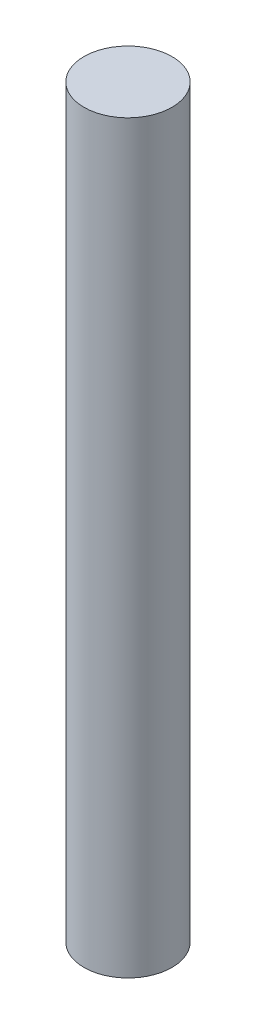
ISO-10303-21;
HEADER;
FILE_DESCRIPTION(('STEP AP214'),'2;1');
FILE_NAME('part.step','',(''),(''),'','','');
FILE_SCHEMA(('AUTOMOTIVE_DESIGN { 1 0 10303 214 1 1 1 1 }'));
ENDSEC;
DATA;
#1=APPLICATION_CONTEXT('core data for automotive mechanical design processes');
#2=APPLICATION_PROTOCOL_DEFINITION('international standard','automotive_design',2000,#1);
#3=PRODUCT_CONTEXT('',#1,'mechanical');
#4=PRODUCT('Part','Part','',(#3));
#5=PRODUCT_RELATED_PRODUCT_CATEGORY('part','',(#4));
#6=PRODUCT_DEFINITION_FORMATION('','',#4);
#7=PRODUCT_DEFINITION_CONTEXT('part definition',#1,'design');
#8=PRODUCT_DEFINITION('design','',#6,#7);
#9=PRODUCT_DEFINITION_SHAPE('','',#8);
#10=(LENGTH_UNIT() NAMED_UNIT(*) SI_UNIT(.MILLI.,.METRE.));
#11=(NAMED_UNIT(*) PLANE_ANGLE_UNIT() SI_UNIT($,.RADIAN.));
#12=(NAMED_UNIT(*) SI_UNIT($,.STERADIAN.) SOLID_ANGLE_UNIT());
#13=UNCERTAINTY_MEASURE_WITH_UNIT(LENGTH_MEASURE(1.E-05),#10,'distance_accuracy_value','');
#14=(GEOMETRIC_REPRESENTATION_CONTEXT(3) GLOBAL_UNCERTAINTY_ASSIGNED_CONTEXT((#13)) GLOBAL_UNIT_ASSIGNED_CONTEXT((#10,
#11,#12)) REPRESENTATION_CONTEXT('',''));
#15=CARTESIAN_POINT('',(0.,0.,0.));
#16=DIRECTION('',(0.,0.,1.));
#17=DIRECTION('',(1.,0.,0.));
#18=AXIS2_PLACEMENT_3D('',#15,#16,#17);
#19=CARTESIAN_POINT('',(0.,12.7,0.));
#20=DIRECTION('',(0.,-1.,0.));
#21=DIRECTION('',(0.,0.,-1.));
#22=AXIS2_PLACEMENT_3D('',#19,#20,#21);
#23=CYLINDRICAL_SURFACE('',#22,0.750000000000001);
#24=CARTESIAN_POINT('',(0.,12.7,0.));
#25=DIRECTION('',(0.,1.,0.));
#26=DIRECTION('',(0.,0.,1.));
#27=AXIS2_PLACEMENT_3D('',#24,#25,#26);
#28=CIRCLE('',#27,0.750000000000001);
#29=CARTESIAN_POINT('',(0.,12.7,0.750000000000001));
#30=VERTEX_POINT('',#29);
#31=EDGE_CURVE('E10',#30,#30,#28,.T.);
#32=ORIENTED_EDGE('',*,*,#31,.F.);
#33=EDGE_LOOP('',(#32));
#34=FACE_BOUND('',#33,.T.);
#35=CARTESIAN_POINT('',(0.,0.,0.));
#36=DIRECTION('',(0.,1.,0.));
#37=DIRECTION('',(0.,0.,1.));
#38=AXIS2_PLACEMENT_3D('',#35,#36,#37);
#39=CIRCLE('',#38,0.750000000000001);
#40=CARTESIAN_POINT('',(0.,0.,0.750000000000001));
#41=VERTEX_POINT('',#40);
#42=EDGE_CURVE('E32',#41,#41,#39,.T.);
#43=ORIENTED_EDGE('',*,*,#42,.T.);
#44=EDGE_LOOP('',(#43));
#45=FACE_BOUND('',#44,.T.);
#46=ADVANCED_FACE('F29',(#34,#45),#23,.T.);
#47=CARTESIAN_POINT('',(0.,12.7,0.));
#48=DIRECTION('',(0.,1.,0.));
#49=DIRECTION('',(0.,0.,1.));
#50=AXIS2_PLACEMENT_3D('',#47,#48,#49);
#51=PLANE('',#50);
#52=ORIENTED_EDGE('',*,*,#31,.T.);
#53=EDGE_LOOP('',(#52));
#54=FACE_BOUND('',#53,.T.);
#55=ADVANCED_FACE('F44',(#54),#51,.T.);
#56=CARTESIAN_POINT('',(0.,0.,0.));
#57=DIRECTION('',(0.,1.,0.));
#58=DIRECTION('',(0.,0.,1.));
#59=AXIS2_PLACEMENT_3D('',#56,#57,#58);
#60=PLANE('',#59);
#61=ORIENTED_EDGE('',*,*,#42,.F.);
#62=EDGE_LOOP('',(#61));
#63=FACE_BOUND('',#62,.T.);
#64=ADVANCED_FACE('F42',(#63),#60,.F.);
#65=CLOSED_SHELL('',(#46,#55,#64));
#66=MANIFOLD_SOLID_BREP('B2',#65);
#67=ADVANCED_BREP_SHAPE_REPRESENTATION('',(#18,#66),#14);
#68=SHAPE_DEFINITION_REPRESENTATION(#9,#67);
ENDSEC;
END-ISO-10303-21;
